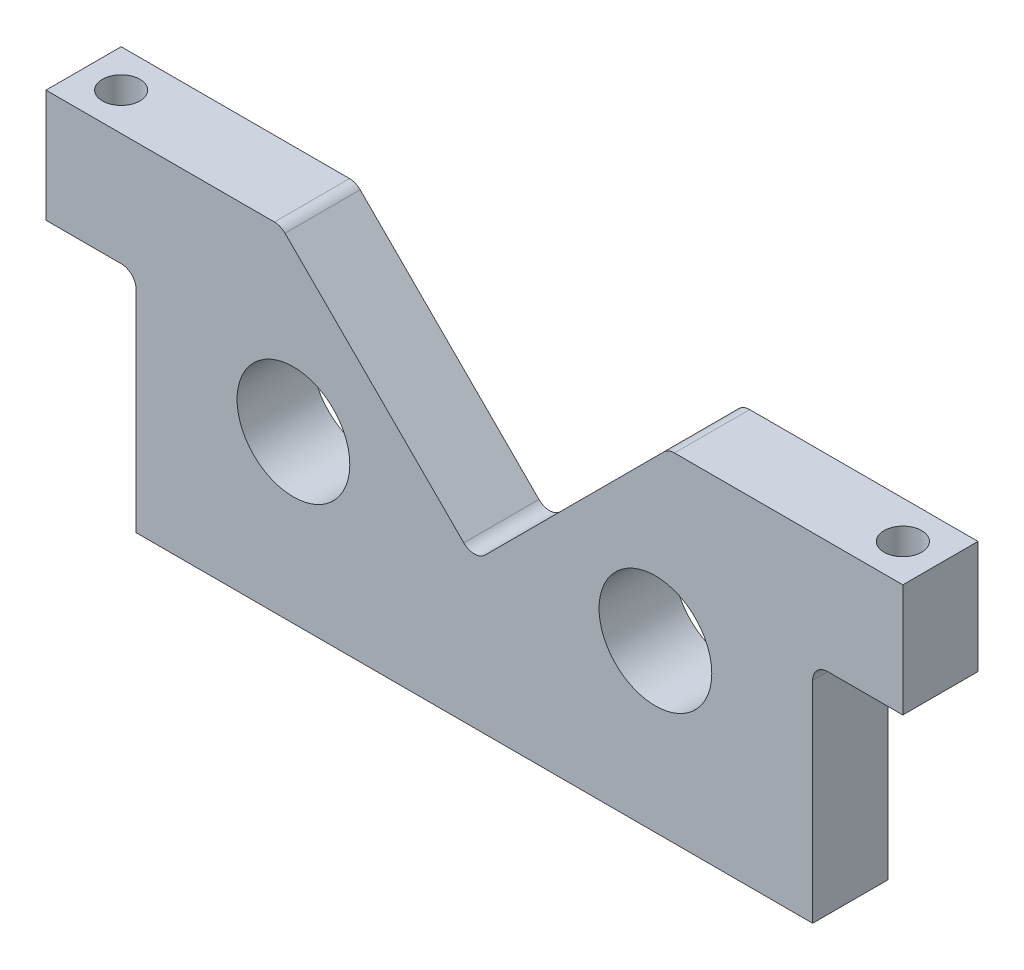
ISO-10303-21;
HEADER;
FILE_DESCRIPTION(('STEP AP214'),'2;1');
FILE_NAME('part.step','',(''),(''),'','','');
FILE_SCHEMA(('AUTOMOTIVE_DESIGN { 1 0 10303 214 1 1 1 1 }'));
ENDSEC;
DATA;
#1=APPLICATION_CONTEXT('core data for automotive mechanical design processes');
#2=APPLICATION_PROTOCOL_DEFINITION('international standard','automotive_design',2000,#1);
#3=PRODUCT_CONTEXT('',#1,'mechanical');
#4=PRODUCT('Part','Part','',(#3));
#5=PRODUCT_RELATED_PRODUCT_CATEGORY('part','',(#4));
#6=PRODUCT_DEFINITION_FORMATION('','',#4);
#7=PRODUCT_DEFINITION_CONTEXT('part definition',#1,'design');
#8=PRODUCT_DEFINITION('design','',#6,#7);
#9=PRODUCT_DEFINITION_SHAPE('','',#8);
#10=(LENGTH_UNIT() NAMED_UNIT(*) SI_UNIT(.MILLI.,.METRE.));
#11=(NAMED_UNIT(*) PLANE_ANGLE_UNIT() SI_UNIT($,.RADIAN.));
#12=(NAMED_UNIT(*) SI_UNIT($,.STERADIAN.) SOLID_ANGLE_UNIT());
#13=UNCERTAINTY_MEASURE_WITH_UNIT(LENGTH_MEASURE(1.E-05),#10,'distance_accuracy_value','');
#14=(GEOMETRIC_REPRESENTATION_CONTEXT(3) GLOBAL_UNCERTAINTY_ASSIGNED_CONTEXT((#13)) GLOBAL_UNIT_ASSIGNED_CONTEXT((#10,
#11,#12)) REPRESENTATION_CONTEXT('',''));
#15=CARTESIAN_POINT('',(0.,0.,0.));
#16=DIRECTION('',(0.,0.,1.));
#17=DIRECTION('',(1.,0.,0.));
#18=AXIS2_PLACEMENT_3D('',#15,#16,#17);
#19=CARTESIAN_POINT('',(45.,0.,5.));
#20=DIRECTION('',(-1.,0.,0.));
#21=DIRECTION('',(0.,-1.,0.));
#22=AXIS2_PLACEMENT_3D('',#19,#20,#21);
#23=PLANE('',#22);
#24=DIRECTION('',(0.,1.,0.));
#25=VECTOR('',#24,1.);
#26=CARTESIAN_POINT('',(45.,0.,-5.));
#27=LINE('',#26,#25);
#28=CARTESIAN_POINT('',(45.,-47.5,-5.));
#29=VERTEX_POINT('',#28);
#30=CARTESIAN_POINT('',(45.,-19.5,-5.));
#31=VERTEX_POINT('',#30);
#32=EDGE_CURVE('E227',#29,#31,#27,.T.);
#33=ORIENTED_EDGE('',*,*,#32,.T.);
#34=DIRECTION('',(0.,0.,-1.));
#35=VECTOR('',#34,1.);
#36=CARTESIAN_POINT('',(45.,-19.5,5.));
#37=LINE('',#36,#35);
#38=CARTESIAN_POINT('',(45.,-19.5,5.));
#39=VERTEX_POINT('',#38);
#40=EDGE_CURVE('E288',#39,#31,#37,.T.);
#41=ORIENTED_EDGE('',*,*,#40,.F.);
#42=DIRECTION('',(0.,1.,0.));
#43=VECTOR('',#42,1.);
#44=CARTESIAN_POINT('',(45.,0.,5.));
#45=LINE('',#44,#43);
#46=CARTESIAN_POINT('',(45.,-47.5,5.));
#47=VERTEX_POINT('',#46);
#48=EDGE_CURVE('E186',#47,#39,#45,.T.);
#49=ORIENTED_EDGE('',*,*,#48,.F.);
#50=DIRECTION('',(0.,0.,-1.));
#51=VECTOR('',#50,1.);
#52=CARTESIAN_POINT('',(45.,-47.5,5.));
#53=LINE('',#52,#51);
#54=EDGE_CURVE('E221',#47,#29,#53,.T.);
#55=ORIENTED_EDGE('',*,*,#54,.T.);
#56=EDGE_LOOP('',(#33,#41,#49,#55));
#57=FACE_BOUND('',#56,.T.);
#58=ADVANCED_FACE('F37',(#57),#23,.F.);
#59=CARTESIAN_POINT('',(47.,-19.5,5.));
#60=DIRECTION('',(0.,0.,-1.));
#61=DIRECTION('',(-1.,0.,0.));
#62=AXIS2_PLACEMENT_3D('',#59,#60,#61);
#63=CYLINDRICAL_SURFACE('',#62,2.);
#64=CARTESIAN_POINT('',(47.,-19.5,-5.));
#65=DIRECTION('',(0.,0.,1.));
#66=DIRECTION('',(1.,0.,0.));
#67=AXIS2_PLACEMENT_3D('',#64,#65,#66);
#68=CIRCLE('',#67,2.);
#69=CARTESIAN_POINT('',(47.,-17.5,-5.));
#70=VERTEX_POINT('',#69);
#71=EDGE_CURVE('E230',#31,#70,#68,.F.);
#72=ORIENTED_EDGE('',*,*,#71,.T.);
#73=DIRECTION('',(0.,0.,-1.));
#74=VECTOR('',#73,1.);
#75=CARTESIAN_POINT('',(47.,-17.5,5.));
#76=LINE('',#75,#74);
#77=CARTESIAN_POINT('',(47.,-17.5,5.));
#78=VERTEX_POINT('',#77);
#79=EDGE_CURVE('E285',#78,#70,#76,.T.);
#80=ORIENTED_EDGE('',*,*,#79,.F.);
#81=CARTESIAN_POINT('',(47.,-19.5,5.));
#82=DIRECTION('',(0.,0.,1.));
#83=DIRECTION('',(1.,0.,0.));
#84=AXIS2_PLACEMENT_3D('',#81,#82,#83);
#85=CIRCLE('',#84,2.);
#86=EDGE_CURVE('E189',#39,#78,#85,.F.);
#87=ORIENTED_EDGE('',*,*,#86,.F.);
#88=ORIENTED_EDGE('',*,*,#40,.T.);
#89=EDGE_LOOP('',(#72,#80,#87,#88));
#90=FACE_BOUND('',#89,.T.);
#91=ADVANCED_FACE('F340',(#90),#63,.F.);
#92=CARTESIAN_POINT('',(0.,-17.4999999999999,5.));
#93=DIRECTION('',(0.,1.,0.));
#94=DIRECTION('',(-1.,0.,0.));
#95=AXIS2_PLACEMENT_3D('',#92,#93,#94);
#96=PLANE('',#95);
#97=CARTESIAN_POINT('',(52.,-17.5,0.));
#98=DIRECTION('',(0.,1.,0.));
#99=DIRECTION('',(-1.,0.,0.));
#100=AXIS2_PLACEMENT_3D('',#97,#98,#99);
#101=CIRCLE('',#100,2.5);
#102=CARTESIAN_POINT('',(49.5,-17.5,0.));
#103=VERTEX_POINT('',#102);
#104=EDGE_CURVE('E434',#103,#103,#101,.T.);
#105=ORIENTED_EDGE('',*,*,#104,.T.);
#106=EDGE_LOOP('',(#105));
#107=FACE_BOUND('',#106,.T.);
#108=DIRECTION('',(1.,0.,0.));
#109=VECTOR('',#108,1.);
#110=CARTESIAN_POINT('',(0.,-17.4999999999999,-5.));
#111=LINE('',#110,#109);
#112=CARTESIAN_POINT('',(57.,-17.5,-5.));
#113=VERTEX_POINT('',#112);
#114=EDGE_CURVE('E232',#70,#113,#111,.T.);
#115=ORIENTED_EDGE('',*,*,#114,.T.);
#116=DIRECTION('',(0.,0.,-1.));
#117=VECTOR('',#116,1.);
#118=CARTESIAN_POINT('',(57.,-17.5,5.));
#119=LINE('',#118,#117);
#120=CARTESIAN_POINT('',(57.,-17.5,5.));
#121=VERTEX_POINT('',#120);
#122=EDGE_CURVE('E283',#121,#113,#119,.T.);
#123=ORIENTED_EDGE('',*,*,#122,.F.);
#124=DIRECTION('',(1.,0.,0.));
#125=VECTOR('',#124,1.);
#126=CARTESIAN_POINT('',(0.,-17.4999999999999,5.));
#127=LINE('',#126,#125);
#128=EDGE_CURVE('E191',#78,#121,#127,.T.);
#129=ORIENTED_EDGE('',*,*,#128,.F.);
#130=ORIENTED_EDGE('',*,*,#79,.T.);
#131=EDGE_LOOP('',(#115,#123,#129,#130));
#132=FACE_BOUND('',#131,.T.);
#133=ADVANCED_FACE('F346',(#107,#132),#96,.F.);
#134=CARTESIAN_POINT('',(57.,0.,5.));
#135=DIRECTION('',(1.,0.,0.));
#136=DIRECTION('',(0.,1.,0.));
#137=AXIS2_PLACEMENT_3D('',#134,#135,#136);
#138=PLANE('',#137);
#139=DIRECTION('',(0.,-1.,0.));
#140=VECTOR('',#139,1.);
#141=CARTESIAN_POINT('',(57.,0.,-5.));
#142=LINE('',#141,#140);
#143=CARTESIAN_POINT('',(57.,-2.49999999999996,-5.));
#144=VERTEX_POINT('',#143);
#145=EDGE_CURVE('E235',#144,#113,#142,.T.);
#146=ORIENTED_EDGE('',*,*,#145,.F.);
#147=DIRECTION('',(0.,0.,-1.));
#148=VECTOR('',#147,1.);
#149=CARTESIAN_POINT('',(57.,-2.49999999999996,5.));
#150=LINE('',#149,#148);
#151=CARTESIAN_POINT('',(57.,-2.49999999999996,5.));
#152=VERTEX_POINT('',#151);
#153=EDGE_CURVE('E280',#152,#144,#150,.T.);
#154=ORIENTED_EDGE('',*,*,#153,.F.);
#155=DIRECTION('',(0.,-1.,0.));
#156=VECTOR('',#155,1.);
#157=CARTESIAN_POINT('',(57.,0.,5.));
#158=LINE('',#157,#156);
#159=EDGE_CURVE('E193',#152,#121,#158,.T.);
#160=ORIENTED_EDGE('',*,*,#159,.T.);
#161=ORIENTED_EDGE('',*,*,#122,.T.);
#162=EDGE_LOOP('',(#146,#154,#160,#161));
#163=FACE_BOUND('',#162,.T.);
#164=ADVANCED_FACE('F382',(#163),#138,.T.);
#165=CARTESIAN_POINT('',(0.,-2.50000000000024,5.));
#166=DIRECTION('',(0.,1.,0.));
#167=DIRECTION('',(-1.,0.,0.));
#168=AXIS2_PLACEMENT_3D('',#165,#166,#167);
#169=PLANE('',#168);
#170=CARTESIAN_POINT('',(52.,-2.49999999999998,0.));
#171=DIRECTION('',(0.,1.,0.));
#172=DIRECTION('',(0.,0.,1.));
#173=AXIS2_PLACEMENT_3D('',#170,#171,#172);
#174=CIRCLE('',#173,2.5);
#175=CARTESIAN_POINT('',(52.,-2.49999999999998,2.5));
#176=VERTEX_POINT('',#175);
#177=EDGE_CURVE('E437',#176,#176,#174,.T.);
#178=ORIENTED_EDGE('',*,*,#177,.F.);
#179=EDGE_LOOP('',(#178));
#180=FACE_BOUND('',#179,.T.);
#181=DIRECTION('',(1.,0.,0.));
#182=VECTOR('',#181,1.);
#183=CARTESIAN_POINT('',(0.,-2.50000000000024,-5.));
#184=LINE('',#183,#182);
#185=CARTESIAN_POINT('',(26.612698372208,-2.50000000000011,-5.));
#186=VERTEX_POINT('',#185);
#187=EDGE_CURVE('E238',#186,#144,#184,.T.);
#188=ORIENTED_EDGE('',*,*,#187,.F.);
#189=DIRECTION('',(0.,0.,-1.));
#190=VECTOR('',#189,1.);
#191=CARTESIAN_POINT('',(26.612698372208,-2.50000000000011,5.));
#192=LINE('',#191,#190);
#193=CARTESIAN_POINT('',(26.612698372208,-2.50000000000011,5.));
#194=VERTEX_POINT('',#193);
#195=EDGE_CURVE('E298',#186,#194,#192,.F.);
#196=ORIENTED_EDGE('',*,*,#195,.T.);
#197=DIRECTION('',(1.,0.,0.));
#198=VECTOR('',#197,1.);
#199=CARTESIAN_POINT('',(0.,-2.50000000000024,5.));
#200=LINE('',#199,#198);
#201=EDGE_CURVE('E196',#194,#152,#200,.T.);
#202=ORIENTED_EDGE('',*,*,#201,.T.);
#203=ORIENTED_EDGE('',*,*,#153,.T.);
#204=EDGE_LOOP('',(#188,#196,#202,#203));
#205=FACE_BOUND('',#204,.T.);
#206=ADVANCED_FACE('F378',(#180,#205),#169,.T.);
#207=CARTESIAN_POINT('',(14.1421356237309,-14.1421356237309,5.));
#208=DIRECTION('',(-0.707106781186547,0.707106781186548,0.));
#209=DIRECTION('',(-0.707106781186548,-0.707106781186547,0.));
#210=AXIS2_PLACEMENT_3D('',#207,#208,#209);
#211=PLANE('',#210);
#212=DIRECTION('',(0.707106781186548,0.707106781186547,0.));
#213=VECTOR('',#212,1.);
#214=CARTESIAN_POINT('',(14.1421356237309,-14.1421356237309,5.));
#215=LINE('',#214,#213);
#216=CARTESIAN_POINT('',(1.41421356237308,-26.8700576850888,5.));
#217=VERTEX_POINT('',#216);
#218=CARTESIAN_POINT('',(25.1984848098349,-3.08578643762701,5.));
#219=VERTEX_POINT('',#218);
#220=EDGE_CURVE('E198',#217,#219,#215,.T.);
#221=ORIENTED_EDGE('',*,*,#220,.T.);
#222=DIRECTION('',(0.,0.,-1.));
#223=VECTOR('',#222,1.);
#224=CARTESIAN_POINT('',(25.1984848098349,-3.08578643762701,5.));
#225=LINE('',#224,#223);
#226=CARTESIAN_POINT('',(25.1984848098349,-3.08578643762701,-5.));
#227=VERTEX_POINT('',#226);
#228=EDGE_CURVE('E291',#219,#227,#225,.T.);
#229=ORIENTED_EDGE('',*,*,#228,.T.);
#230=DIRECTION('',(0.707106781186548,0.707106781186547,0.));
#231=VECTOR('',#230,1.);
#232=CARTESIAN_POINT('',(14.1421356237309,-14.1421356237309,-5.));
#233=LINE('',#232,#231);
#234=CARTESIAN_POINT('',(1.41421356237308,-26.8700576850888,-5.));
#235=VERTEX_POINT('',#234);
#236=EDGE_CURVE('E240',#235,#227,#233,.T.);
#237=ORIENTED_EDGE('',*,*,#236,.F.);
#238=DIRECTION('',(0.,0.,-1.));
#239=VECTOR('',#238,1.);
#240=CARTESIAN_POINT('',(1.41421356237308,-26.8700576850888,5.));
#241=LINE('',#240,#239);
#242=EDGE_CURVE('E278',#217,#235,#241,.T.);
#243=ORIENTED_EDGE('',*,*,#242,.F.);
#244=EDGE_LOOP('',(#221,#229,#237,#243));
#245=FACE_BOUND('',#244,.T.);
#246=ADVANCED_FACE('F368',(#245),#211,.T.);
#247=CARTESIAN_POINT('',(0.,-25.4558441227157,5.));
#248=DIRECTION('',(0.,0.,-1.));
#249=DIRECTION('',(-1.,0.,0.));
#250=AXIS2_PLACEMENT_3D('',#247,#248,#249);
#251=CYLINDRICAL_SURFACE('',#250,2.);
#252=CARTESIAN_POINT('',(0.,-25.4558441227157,-5.));
#253=DIRECTION('',(0.,0.,1.));
#254=DIRECTION('',(1.,0.,0.));
#255=AXIS2_PLACEMENT_3D('',#252,#253,#254);
#256=CIRCLE('',#255,2.);
#257=CARTESIAN_POINT('',(-1.41421356237311,-26.8700576850888,-5.));
#258=VERTEX_POINT('',#257);
#259=EDGE_CURVE('E243',#235,#258,#256,.F.);
#260=ORIENTED_EDGE('',*,*,#259,.T.);
#261=DIRECTION('',(0.,0.,-1.));
#262=VECTOR('',#261,1.);
#263=CARTESIAN_POINT('',(-1.41421356237311,-26.8700576850888,5.));
#264=LINE('',#263,#262);
#265=CARTESIAN_POINT('',(-1.41421356237311,-26.8700576850888,5.));
#266=VERTEX_POINT('',#265);
#267=EDGE_CURVE('E275',#266,#258,#264,.T.);
#268=ORIENTED_EDGE('',*,*,#267,.F.);
#269=CARTESIAN_POINT('',(0.,-25.4558441227157,5.));
#270=DIRECTION('',(0.,0.,1.));
#271=DIRECTION('',(1.,0.,0.));
#272=AXIS2_PLACEMENT_3D('',#269,#270,#271);
#273=CIRCLE('',#272,2.);
#274=EDGE_CURVE('E201',#217,#266,#273,.F.);
#275=ORIENTED_EDGE('',*,*,#274,.F.);
#276=ORIENTED_EDGE('',*,*,#242,.T.);
#277=EDGE_LOOP('',(#260,#268,#275,#276));
#278=FACE_BOUND('',#277,.T.);
#279=ADVANCED_FACE('F374',(#278),#251,.F.);
#280=CARTESIAN_POINT('',(-14.142135623731,-14.1421356237309,5.));
#281=DIRECTION('',(-0.707106781186548,-0.707106781186547,0.));
#282=DIRECTION('',(0.707106781186547,-0.707106781186548,0.));
#283=AXIS2_PLACEMENT_3D('',#280,#281,#282);
#284=PLANE('',#283);
#285=DIRECTION('',(-0.707106781186547,0.707106781186548,0.));
#286=VECTOR('',#285,1.);
#287=CARTESIAN_POINT('',(-14.142135623731,-14.1421356237309,-5.));
#288=LINE('',#287,#286);
#289=CARTESIAN_POINT('',(-25.198484809835,-3.08578643762692,-5.));
#290=VERTEX_POINT('',#289);
#291=EDGE_CURVE('E245',#258,#290,#288,.T.);
#292=ORIENTED_EDGE('',*,*,#291,.T.);
#293=DIRECTION('',(0.,0.,-1.));
#294=VECTOR('',#293,1.);
#295=CARTESIAN_POINT('',(-25.198484809835,-3.08578643762692,5.));
#296=LINE('',#295,#294);
#297=CARTESIAN_POINT('',(-25.198484809835,-3.08578643762692,5.));
#298=VERTEX_POINT('',#297);
#299=EDGE_CURVE('E11',#290,#298,#296,.F.);
#300=ORIENTED_EDGE('',*,*,#299,.T.);
#301=DIRECTION('',(-0.707106781186547,0.707106781186548,0.));
#302=VECTOR('',#301,1.);
#303=CARTESIAN_POINT('',(-14.142135623731,-14.1421356237309,5.));
#304=LINE('',#303,#302);
#305=EDGE_CURVE('E203',#266,#298,#304,.T.);
#306=ORIENTED_EDGE('',*,*,#305,.F.);
#307=ORIENTED_EDGE('',*,*,#267,.T.);
#308=EDGE_LOOP('',(#292,#300,#306,#307));
#309=FACE_BOUND('',#308,.T.);
#310=ADVANCED_FACE('F375',(#309),#284,.F.);
#311=CARTESIAN_POINT('',(0.,-2.50000000000002,5.));
#312=DIRECTION('',(0.,1.,0.));
#313=DIRECTION('',(0.,0.,1.));
#314=AXIS2_PLACEMENT_3D('',#311,#312,#313);
#315=PLANE('',#314);
#316=CARTESIAN_POINT('',(-52.,-2.5000000000005,0.));
#317=DIRECTION('',(0.,1.,0.));
#318=DIRECTION('',(0.,0.,1.));
#319=AXIS2_PLACEMENT_3D('',#316,#317,#318);
#320=CIRCLE('',#319,2.5);
#321=CARTESIAN_POINT('',(-52.,-2.5000000000005,2.5));
#322=VERTEX_POINT('',#321);
#323=EDGE_CURVE('E436',#322,#322,#320,.T.);
#324=ORIENTED_EDGE('',*,*,#323,.F.);
#325=EDGE_LOOP('',(#324));
#326=FACE_BOUND('',#325,.T.);
#327=DIRECTION('',(1.,0.,0.));
#328=VECTOR('',#327,1.);
#329=CARTESIAN_POINT('',(0.,-2.50000000000002,5.));
#330=LINE('',#329,#328);
#331=CARTESIAN_POINT('',(-57.,-2.49999999999996,5.));
#332=VERTEX_POINT('',#331);
#333=CARTESIAN_POINT('',(-26.6126983722081,-2.50000000000002,5.));
#334=VERTEX_POINT('',#333);
#335=EDGE_CURVE('E205',#332,#334,#330,.T.);
#336=ORIENTED_EDGE('',*,*,#335,.T.);
#337=DIRECTION('',(0.,0.,-1.));
#338=VECTOR('',#337,1.);
#339=CARTESIAN_POINT('',(-26.6126983722081,-2.50000000000002,-5.));
#340=LINE('',#339,#338);
#341=CARTESIAN_POINT('',(-26.6126983722081,-2.50000000000002,-5.));
#342=VERTEX_POINT('',#341);
#343=EDGE_CURVE('E45',#334,#342,#340,.T.);
#344=ORIENTED_EDGE('',*,*,#343,.T.);
#345=DIRECTION('',(1.,0.,0.));
#346=VECTOR('',#345,1.);
#347=CARTESIAN_POINT('',(0.,-2.50000000000002,-5.));
#348=LINE('',#347,#346);
#349=CARTESIAN_POINT('',(-57.,-2.49999999999996,-5.));
#350=VERTEX_POINT('',#349);
#351=EDGE_CURVE('E247',#350,#342,#348,.T.);
#352=ORIENTED_EDGE('',*,*,#351,.F.);
#353=DIRECTION('',(0.,0.,-1.));
#354=VECTOR('',#353,1.);
#355=CARTESIAN_POINT('',(-57.,-2.49999999999996,5.));
#356=LINE('',#355,#354);
#357=EDGE_CURVE('E273',#332,#350,#356,.T.);
#358=ORIENTED_EDGE('',*,*,#357,.F.);
#359=EDGE_LOOP('',(#336,#344,#352,#358));
#360=FACE_BOUND('',#359,.T.);
#361=ADVANCED_FACE('F306',(#326,#360),#315,.T.);
#362=CARTESIAN_POINT('',(-57.,0.,5.));
#363=DIRECTION('',(1.,0.,0.));
#364=DIRECTION('',(0.,1.,0.));
#365=AXIS2_PLACEMENT_3D('',#362,#363,#364);
#366=PLANE('',#365);
#367=DIRECTION('',(0.,-1.,0.));
#368=VECTOR('',#367,1.);
#369=CARTESIAN_POINT('',(-57.,0.,-5.));
#370=LINE('',#369,#368);
#371=CARTESIAN_POINT('',(-57.,-17.5,-5.));
#372=VERTEX_POINT('',#371);
#373=EDGE_CURVE('E250',#350,#372,#370,.T.);
#374=ORIENTED_EDGE('',*,*,#373,.T.);
#375=DIRECTION('',(0.,0.,-1.));
#376=VECTOR('',#375,1.);
#377=CARTESIAN_POINT('',(-57.,-17.5,5.));
#378=LINE('',#377,#376);
#379=CARTESIAN_POINT('',(-57.,-17.5,5.));
#380=VERTEX_POINT('',#379);
#381=EDGE_CURVE('E271',#380,#372,#378,.T.);
#382=ORIENTED_EDGE('',*,*,#381,.F.);
#383=DIRECTION('',(0.,-1.,0.));
#384=VECTOR('',#383,1.);
#385=CARTESIAN_POINT('',(-57.,0.,5.));
#386=LINE('',#385,#384);
#387=EDGE_CURVE('E207',#332,#380,#386,.T.);
#388=ORIENTED_EDGE('',*,*,#387,.F.);
#389=ORIENTED_EDGE('',*,*,#357,.T.);
#390=EDGE_LOOP('',(#374,#382,#388,#389));
#391=FACE_BOUND('',#390,.T.);
#392=ADVANCED_FACE('F315',(#391),#366,.F.);
#393=CARTESIAN_POINT('',(0.,-17.5,5.));
#394=DIRECTION('',(0.,-1.,0.));
#395=DIRECTION('',(1.,0.,0.));
#396=AXIS2_PLACEMENT_3D('',#393,#394,#395);
#397=PLANE('',#396);
#398=CARTESIAN_POINT('',(-52.,-17.5,0.));
#399=DIRECTION('',(0.,-1.,0.));
#400=DIRECTION('',(1.,0.,0.));
#401=AXIS2_PLACEMENT_3D('',#398,#399,#400);
#402=CIRCLE('',#401,2.5);
#403=CARTESIAN_POINT('',(-49.5,-17.5,0.));
#404=VERTEX_POINT('',#403);
#405=EDGE_CURVE('E172',#404,#404,#402,.T.);
#406=ORIENTED_EDGE('',*,*,#405,.F.);
#407=EDGE_LOOP('',(#406));
#408=FACE_BOUND('',#407,.T.);
#409=DIRECTION('',(-1.,0.,0.));
#410=VECTOR('',#409,1.);
#411=CARTESIAN_POINT('',(0.,-17.5,-5.));
#412=LINE('',#411,#410);
#413=CARTESIAN_POINT('',(-47.,-17.5,-5.));
#414=VERTEX_POINT('',#413);
#415=EDGE_CURVE('E253',#414,#372,#412,.T.);
#416=ORIENTED_EDGE('',*,*,#415,.F.);
#417=DIRECTION('',(0.,0.,-1.));
#418=VECTOR('',#417,1.);
#419=CARTESIAN_POINT('',(-47.,-17.5,5.));
#420=LINE('',#419,#418);
#421=CARTESIAN_POINT('',(-47.,-17.5,5.));
#422=VERTEX_POINT('',#421);
#423=EDGE_CURVE('E269',#422,#414,#420,.T.);
#424=ORIENTED_EDGE('',*,*,#423,.F.);
#425=DIRECTION('',(-1.,0.,0.));
#426=VECTOR('',#425,1.);
#427=CARTESIAN_POINT('',(0.,-17.5,5.));
#428=LINE('',#427,#426);
#429=EDGE_CURVE('E209',#422,#380,#428,.T.);
#430=ORIENTED_EDGE('',*,*,#429,.T.);
#431=ORIENTED_EDGE('',*,*,#381,.T.);
#432=EDGE_LOOP('',(#416,#424,#430,#431));
#433=FACE_BOUND('',#432,.T.);
#434=ADVANCED_FACE('F402',(#408,#433),#397,.T.);
#435=CARTESIAN_POINT('',(-47.,-19.5,5.));
#436=DIRECTION('',(0.,0.,-1.));
#437=DIRECTION('',(-1.,0.,0.));
#438=AXIS2_PLACEMENT_3D('',#435,#436,#437);
#439=CYLINDRICAL_SURFACE('',#438,2.);
#440=CARTESIAN_POINT('',(-47.,-19.5,-5.));
#441=DIRECTION('',(0.,0.,1.));
#442=DIRECTION('',(1.,0.,0.));
#443=AXIS2_PLACEMENT_3D('',#440,#441,#442);
#444=CIRCLE('',#443,2.);
#445=CARTESIAN_POINT('',(-45.,-19.5,-5.));
#446=VERTEX_POINT('',#445);
#447=EDGE_CURVE('E256',#446,#414,#444,.T.);
#448=ORIENTED_EDGE('',*,*,#447,.F.);
#449=DIRECTION('',(0.,0.,-1.));
#450=VECTOR('',#449,1.);
#451=CARTESIAN_POINT('',(-45.,-19.5,5.));
#452=LINE('',#451,#450);
#453=CARTESIAN_POINT('',(-45.,-19.5,5.));
#454=VERTEX_POINT('',#453);
#455=EDGE_CURVE('E267',#454,#446,#452,.T.);
#456=ORIENTED_EDGE('',*,*,#455,.F.);
#457=CARTESIAN_POINT('',(-47.,-19.5,5.));
#458=DIRECTION('',(0.,0.,1.));
#459=DIRECTION('',(1.,0.,0.));
#460=AXIS2_PLACEMENT_3D('',#457,#458,#459);
#461=CIRCLE('',#460,2.);
#462=EDGE_CURVE('E212',#454,#422,#461,.T.);
#463=ORIENTED_EDGE('',*,*,#462,.T.);
#464=ORIENTED_EDGE('',*,*,#423,.T.);
#465=EDGE_LOOP('',(#448,#456,#463,#464));
#466=FACE_BOUND('',#465,.T.);
#467=ADVANCED_FACE('F399',(#466),#439,.F.);
#468=CARTESIAN_POINT('',(-45.,0.,5.));
#469=DIRECTION('',(-1.,0.,0.));
#470=DIRECTION('',(0.,-1.,0.));
#471=AXIS2_PLACEMENT_3D('',#468,#469,#470);
#472=PLANE('',#471);
#473=DIRECTION('',(0.,1.,0.));
#474=VECTOR('',#473,1.);
#475=CARTESIAN_POINT('',(-45.,0.,-5.));
#476=LINE('',#475,#474);
#477=CARTESIAN_POINT('',(-45.,-47.5,-5.));
#478=VERTEX_POINT('',#477);
#479=EDGE_CURVE('E259',#478,#446,#476,.T.);
#480=ORIENTED_EDGE('',*,*,#479,.F.);
#481=DIRECTION('',(0.,0.,-1.));
#482=VECTOR('',#481,1.);
#483=CARTESIAN_POINT('',(-45.,-47.5,5.));
#484=LINE('',#483,#482);
#485=CARTESIAN_POINT('',(-45.,-47.5,5.));
#486=VERTEX_POINT('',#485);
#487=EDGE_CURVE('E265',#486,#478,#484,.T.);
#488=ORIENTED_EDGE('',*,*,#487,.F.);
#489=DIRECTION('',(0.,1.,0.));
#490=VECTOR('',#489,1.);
#491=CARTESIAN_POINT('',(-45.,0.,5.));
#492=LINE('',#491,#490);
#493=EDGE_CURVE('E215',#486,#454,#492,.T.);
#494=ORIENTED_EDGE('',*,*,#493,.T.);
#495=ORIENTED_EDGE('',*,*,#455,.T.);
#496=EDGE_LOOP('',(#480,#488,#494,#495));
#497=FACE_BOUND('',#496,.T.);
#498=ADVANCED_FACE('F354',(#497),#472,.T.);
#499=CARTESIAN_POINT('',(-24.0798525485149,-25.4176221345435,5.));
#500=DIRECTION('',(0.,0.,-1.));
#501=DIRECTION('',(-1.,0.,0.));
#502=AXIS2_PLACEMENT_3D('',#499,#500,#501);
#503=CYLINDRICAL_SURFACE('',#502,7.5);
#504=CARTESIAN_POINT('',(-24.0798525485149,-25.4176221345435,5.));
#505=DIRECTION('',(0.,0.,1.));
#506=DIRECTION('',(1.,0.,0.));
#507=AXIS2_PLACEMENT_3D('',#504,#505,#506);
#508=CIRCLE('',#507,7.5);
#509=CARTESIAN_POINT('',(-16.5798525485149,-25.4176221345435,5.));
#510=VERTEX_POINT('',#509);
#511=EDGE_CURVE('E182',#510,#510,#508,.F.);
#512=ORIENTED_EDGE('',*,*,#511,.F.);
#513=EDGE_LOOP('',(#512));
#514=FACE_BOUND('',#513,.T.);
#515=CARTESIAN_POINT('',(-24.0798525485149,-25.4176221345435,-5.));
#516=DIRECTION('',(0.,0.,1.));
#517=DIRECTION('',(1.,0.,0.));
#518=AXIS2_PLACEMENT_3D('',#515,#516,#517);
#519=CIRCLE('',#518,7.5);
#520=CARTESIAN_POINT('',(-16.5798525485149,-25.4176221345435,-5.));
#521=VERTEX_POINT('',#520);
#522=EDGE_CURVE('E224',#521,#521,#519,.F.);
#523=ORIENTED_EDGE('',*,*,#522,.T.);
#524=EDGE_LOOP('',(#523));
#525=FACE_BOUND('',#524,.T.);
#526=ADVANCED_FACE('F351',(#514,#525),#503,.F.);
#527=CARTESIAN_POINT('',(24.0798525485149,-25.4176221345435,5.));
#528=DIRECTION('',(0.,0.,-1.));
#529=DIRECTION('',(-1.,0.,0.));
#530=AXIS2_PLACEMENT_3D('',#527,#528,#529);
#531=CYLINDRICAL_SURFACE('',#530,7.50000000000002);
#532=CARTESIAN_POINT('',(24.0798525485149,-25.4176221345435,5.));
#533=DIRECTION('',(0.,0.,1.));
#534=DIRECTION('',(1.,0.,0.));
#535=AXIS2_PLACEMENT_3D('',#532,#533,#534);
#536=CIRCLE('',#535,7.50000000000002);
#537=CARTESIAN_POINT('',(31.5798525485149,-25.4176221345435,5.));
#538=VERTEX_POINT('',#537);
#539=EDGE_CURVE('E179',#538,#538,#536,.T.);
#540=ORIENTED_EDGE('',*,*,#539,.T.);
#541=EDGE_LOOP('',(#540));
#542=FACE_BOUND('',#541,.T.);
#543=CARTESIAN_POINT('',(24.0798525485149,-25.4176221345435,-5.));
#544=DIRECTION('',(0.,0.,1.));
#545=DIRECTION('',(1.,0.,0.));
#546=AXIS2_PLACEMENT_3D('',#543,#544,#545);
#547=CIRCLE('',#546,7.50000000000002);
#548=CARTESIAN_POINT('',(31.5798525485149,-25.4176221345435,-5.));
#549=VERTEX_POINT('',#548);
#550=EDGE_CURVE('E178',#549,#549,#547,.T.);
#551=ORIENTED_EDGE('',*,*,#550,.F.);
#552=EDGE_LOOP('',(#551));
#553=FACE_BOUND('',#552,.T.);
#554=ADVANCED_FACE('F333',(#542,#553),#531,.F.);
#555=CARTESIAN_POINT('',(0.,-47.5,5.));
#556=DIRECTION('',(0.,-1.,0.));
#557=DIRECTION('',(0.,0.,-1.));
#558=AXIS2_PLACEMENT_3D('',#555,#556,#557);
#559=PLANE('',#558);
#560=CARTESIAN_POINT('',(-35.,-47.5,0.));
#561=DIRECTION('',(0.,-1.,0.));
#562=DIRECTION('',(0.,0.,-1.));
#563=AXIS2_PLACEMENT_3D('',#560,#561,#562);
#564=CIRCLE('',#563,2.1);
#565=CARTESIAN_POINT('',(-35.,-47.5,-2.1));
#566=VERTEX_POINT('',#565);
#567=EDGE_CURVE('E166',#566,#566,#564,.T.);
#568=ORIENTED_EDGE('',*,*,#567,.F.);
#569=EDGE_LOOP('',(#568));
#570=FACE_BOUND('',#569,.T.);
#571=CARTESIAN_POINT('',(35.,-47.5,0.));
#572=DIRECTION('',(0.,-1.,0.));
#573=DIRECTION('',(0.,0.,-1.));
#574=AXIS2_PLACEMENT_3D('',#571,#572,#573);
#575=CIRCLE('',#574,2.1);
#576=CARTESIAN_POINT('',(35.,-47.5,-2.1));
#577=VERTEX_POINT('',#576);
#578=EDGE_CURVE('E165',#577,#577,#575,.T.);
#579=ORIENTED_EDGE('',*,*,#578,.F.);
#580=EDGE_LOOP('',(#579));
#581=FACE_BOUND('',#580,.T.);
#582=DIRECTION('',(-1.,0.,0.));
#583=VECTOR('',#582,1.);
#584=CARTESIAN_POINT('',(0.,-47.5,-5.));
#585=LINE('',#584,#583);
#586=EDGE_CURVE('E183',#29,#478,#585,.T.);
#587=ORIENTED_EDGE('',*,*,#586,.F.);
#588=ORIENTED_EDGE('',*,*,#54,.F.);
#589=DIRECTION('',(-1.,0.,0.));
#590=VECTOR('',#589,1.);
#591=CARTESIAN_POINT('',(0.,-47.5,5.));
#592=LINE('',#591,#590);
#593=EDGE_CURVE('E218',#47,#486,#592,.T.);
#594=ORIENTED_EDGE('',*,*,#593,.T.);
#595=ORIENTED_EDGE('',*,*,#487,.T.);
#596=EDGE_LOOP('',(#587,#588,#594,#595));
#597=FACE_BOUND('',#596,.T.);
#598=ADVANCED_FACE('F323',(#570,#581,#597),#559,.T.);
#599=CARTESIAN_POINT('',(0.,0.,5.));
#600=DIRECTION('',(0.,0.,1.));
#601=DIRECTION('',(1.,0.,0.));
#602=AXIS2_PLACEMENT_3D('',#599,#600,#601);
#603=PLANE('',#602);
#604=ORIENTED_EDGE('',*,*,#539,.F.);
#605=EDGE_LOOP('',(#604));
#606=FACE_BOUND('',#605,.T.);
#607=ORIENTED_EDGE('',*,*,#511,.T.);
#608=EDGE_LOOP('',(#607));
#609=FACE_BOUND('',#608,.T.);
#610=ORIENTED_EDGE('',*,*,#201,.F.);
#611=CARTESIAN_POINT('',(26.612698372208,-4.50000000000011,5.));
#612=DIRECTION('',(0.,0.,1.));
#613=DIRECTION('',(1.,0.,0.));
#614=AXIS2_PLACEMENT_3D('',#611,#612,#613);
#615=CIRCLE('',#614,2.);
#616=EDGE_CURVE('E301',#194,#219,#615,.T.);
#617=ORIENTED_EDGE('',*,*,#616,.T.);
#618=ORIENTED_EDGE('',*,*,#220,.F.);
#619=ORIENTED_EDGE('',*,*,#274,.T.);
#620=ORIENTED_EDGE('',*,*,#305,.T.);
#621=CARTESIAN_POINT('',(-26.6126983722081,-4.50000000000002,5.));
#622=DIRECTION('',(0.,0.,1.));
#623=DIRECTION('',(1.,0.,0.));
#624=AXIS2_PLACEMENT_3D('',#621,#622,#623);
#625=CIRCLE('',#624,2.);
#626=EDGE_CURVE('E52',#298,#334,#625,.T.);
#627=ORIENTED_EDGE('',*,*,#626,.T.);
#628=ORIENTED_EDGE('',*,*,#335,.F.);
#629=ORIENTED_EDGE('',*,*,#387,.T.);
#630=ORIENTED_EDGE('',*,*,#429,.F.);
#631=ORIENTED_EDGE('',*,*,#462,.F.);
#632=ORIENTED_EDGE('',*,*,#493,.F.);
#633=ORIENTED_EDGE('',*,*,#593,.F.);
#634=ORIENTED_EDGE('',*,*,#48,.T.);
#635=ORIENTED_EDGE('',*,*,#86,.T.);
#636=ORIENTED_EDGE('',*,*,#128,.T.);
#637=ORIENTED_EDGE('',*,*,#159,.F.);
#638=EDGE_LOOP('',(#610,#617,#618,#619,#620,#627,#628,#629,#630,#631,#632,#633,#634,#635,#636,#637));
#639=FACE_BOUND('',#638,.T.);
#640=ADVANCED_FACE('F319',(#606,#609,#639),#603,.T.);
#641=CARTESIAN_POINT('',(0.,0.,-5.));
#642=DIRECTION('',(0.,0.,1.));
#643=DIRECTION('',(1.,0.,0.));
#644=AXIS2_PLACEMENT_3D('',#641,#642,#643);
#645=PLANE('',#644);
#646=ORIENTED_EDGE('',*,*,#550,.T.);
#647=EDGE_LOOP('',(#646));
#648=FACE_BOUND('',#647,.T.);
#649=ORIENTED_EDGE('',*,*,#522,.F.);
#650=EDGE_LOOP('',(#649));
#651=FACE_BOUND('',#650,.T.);
#652=ORIENTED_EDGE('',*,*,#236,.T.);
#653=CARTESIAN_POINT('',(26.612698372208,-4.50000000000011,-5.));
#654=DIRECTION('',(0.,0.,1.));
#655=DIRECTION('',(1.,0.,0.));
#656=AXIS2_PLACEMENT_3D('',#653,#654,#655);
#657=CIRCLE('',#656,2.);
#658=EDGE_CURVE('E296',#227,#186,#657,.F.);
#659=ORIENTED_EDGE('',*,*,#658,.T.);
#660=ORIENTED_EDGE('',*,*,#187,.T.);
#661=ORIENTED_EDGE('',*,*,#145,.T.);
#662=ORIENTED_EDGE('',*,*,#114,.F.);
#663=ORIENTED_EDGE('',*,*,#71,.F.);
#664=ORIENTED_EDGE('',*,*,#32,.F.);
#665=ORIENTED_EDGE('',*,*,#586,.T.);
#666=ORIENTED_EDGE('',*,*,#479,.T.);
#667=ORIENTED_EDGE('',*,*,#447,.T.);
#668=ORIENTED_EDGE('',*,*,#415,.T.);
#669=ORIENTED_EDGE('',*,*,#373,.F.);
#670=ORIENTED_EDGE('',*,*,#351,.T.);
#671=CARTESIAN_POINT('',(-26.6126983722081,-4.50000000000002,-5.));
#672=DIRECTION('',(0.,0.,1.));
#673=DIRECTION('',(1.,0.,0.));
#674=AXIS2_PLACEMENT_3D('',#671,#672,#673);
#675=CIRCLE('',#674,2.);
#676=EDGE_CURVE('E294',#342,#290,#675,.F.);
#677=ORIENTED_EDGE('',*,*,#676,.T.);
#678=ORIENTED_EDGE('',*,*,#291,.F.);
#679=ORIENTED_EDGE('',*,*,#259,.F.);
#680=EDGE_LOOP('',(#652,#659,#660,#661,#662,#663,#664,#665,#666,#667,#668,#669,#670,#677,#678,#679));
#681=FACE_BOUND('',#680,.T.);
#682=ADVANCED_FACE('F310',(#648,#651,#681),#645,.F.);
#683=CARTESIAN_POINT('',(26.612698372208,-4.50000000000011,5.));
#684=DIRECTION('',(0.,0.,-1.));
#685=DIRECTION('',(-1.,0.,0.));
#686=AXIS2_PLACEMENT_3D('',#683,#684,#685);
#687=CYLINDRICAL_SURFACE('',#686,2.);
#688=ORIENTED_EDGE('',*,*,#616,.F.);
#689=ORIENTED_EDGE('',*,*,#195,.F.);
#690=ORIENTED_EDGE('',*,*,#658,.F.);
#691=ORIENTED_EDGE('',*,*,#228,.F.);
#692=EDGE_LOOP('',(#688,#689,#690,#691));
#693=FACE_BOUND('',#692,.T.);
#694=ADVANCED_FACE('F330',(#693),#687,.T.);
#695=CARTESIAN_POINT('',(-26.6126983722081,-4.50000000000002,5.));
#696=DIRECTION('',(0.,0.,1.));
#697=DIRECTION('',(1.,0.,0.));
#698=AXIS2_PLACEMENT_3D('',#695,#696,#697);
#699=CYLINDRICAL_SURFACE('',#698,2.);
#700=ORIENTED_EDGE('',*,*,#626,.F.);
#701=ORIENTED_EDGE('',*,*,#299,.F.);
#702=ORIENTED_EDGE('',*,*,#676,.F.);
#703=ORIENTED_EDGE('',*,*,#343,.F.);
#704=EDGE_LOOP('',(#700,#701,#702,#703));
#705=FACE_BOUND('',#704,.T.);
#706=ADVANCED_FACE('F39',(#705),#699,.T.);
#707=CARTESIAN_POINT('',(35.,-32.5,0.));
#708=DIRECTION('',(0.,-1.,0.));
#709=DIRECTION('',(0.,0.,-1.));
#710=AXIS2_PLACEMENT_3D('',#707,#708,#709);
#711=CONICAL_SURFACE('',#710,2.1,1.02974425867665);
#712=CARTESIAN_POINT('',(35.,-31.2381927000421,0.));
#713=VERTEX_POINT('',#712);
#714=VERTEX_LOOP('',#713);
#715=FACE_BOUND('',#714,.T.);
#716=CARTESIAN_POINT('',(35.,-32.5,0.));
#717=DIRECTION('',(0.,-1.,0.));
#718=DIRECTION('',(0.,0.,-1.));
#719=AXIS2_PLACEMENT_3D('',#716,#717,#718);
#720=CIRCLE('',#719,2.1);
#721=CARTESIAN_POINT('',(35.,-32.5,-2.1));
#722=VERTEX_POINT('',#721);
#723=EDGE_CURVE('E169',#722,#722,#720,.T.);
#724=ORIENTED_EDGE('',*,*,#723,.T.);
#725=EDGE_LOOP('',(#724));
#726=FACE_BOUND('',#725,.T.);
#727=ADVANCED_FACE('F363',(#715,#726),#711,.F.);
#728=CARTESIAN_POINT('',(35.,-47.5,0.));
#729=DIRECTION('',(0.,-1.,0.));
#730=DIRECTION('',(0.,0.,-1.));
#731=AXIS2_PLACEMENT_3D('',#728,#729,#730);
#732=CYLINDRICAL_SURFACE('',#731,2.1);
#733=ORIENTED_EDGE('',*,*,#723,.F.);
#734=EDGE_LOOP('',(#733));
#735=FACE_BOUND('',#734,.T.);
#736=ORIENTED_EDGE('',*,*,#578,.T.);
#737=EDGE_LOOP('',(#736));
#738=FACE_BOUND('',#737,.T.);
#739=ADVANCED_FACE('F159',(#735,#738),#732,.F.);
#740=CARTESIAN_POINT('',(-35.,-32.5,0.));
#741=DIRECTION('',(0.,-1.,0.));
#742=DIRECTION('',(0.,0.,-1.));
#743=AXIS2_PLACEMENT_3D('',#740,#741,#742);
#744=CONICAL_SURFACE('',#743,2.1,1.02974425867665);
#745=CARTESIAN_POINT('',(-35.,-31.2381927000421,0.));
#746=VERTEX_POINT('',#745);
#747=VERTEX_LOOP('',#746);
#748=FACE_BOUND('',#747,.T.);
#749=CARTESIAN_POINT('',(-35.,-32.5,0.));
#750=DIRECTION('',(0.,-1.,0.));
#751=DIRECTION('',(0.,0.,-1.));
#752=AXIS2_PLACEMENT_3D('',#749,#750,#751);
#753=CIRCLE('',#752,2.1);
#754=CARTESIAN_POINT('',(-35.,-32.5,-2.1));
#755=VERTEX_POINT('',#754);
#756=EDGE_CURVE('E163',#755,#755,#753,.T.);
#757=ORIENTED_EDGE('',*,*,#756,.T.);
#758=EDGE_LOOP('',(#757));
#759=FACE_BOUND('',#758,.T.);
#760=ADVANCED_FACE('F155',(#748,#759),#744,.F.);
#761=CARTESIAN_POINT('',(-35.,-47.5,0.));
#762=DIRECTION('',(0.,-1.,0.));
#763=DIRECTION('',(0.,0.,-1.));
#764=AXIS2_PLACEMENT_3D('',#761,#762,#763);
#765=CYLINDRICAL_SURFACE('',#764,2.1);
#766=ORIENTED_EDGE('',*,*,#756,.F.);
#767=EDGE_LOOP('',(#766));
#768=FACE_BOUND('',#767,.T.);
#769=ORIENTED_EDGE('',*,*,#567,.T.);
#770=EDGE_LOOP('',(#769));
#771=FACE_BOUND('',#770,.T.);
#772=ADVANCED_FACE('F158',(#768,#771),#765,.F.);
#773=CARTESIAN_POINT('',(-52.,-2.5000000000005,0.));
#774=DIRECTION('',(0.,1.,0.));
#775=DIRECTION('',(0.,0.,1.));
#776=AXIS2_PLACEMENT_3D('',#773,#774,#775);
#777=CYLINDRICAL_SURFACE('',#776,2.5);
#778=ORIENTED_EDGE('',*,*,#405,.T.);
#779=EDGE_LOOP('',(#778));
#780=FACE_BOUND('',#779,.T.);
#781=ORIENTED_EDGE('',*,*,#323,.T.);
#782=EDGE_LOOP('',(#781));
#783=FACE_BOUND('',#782,.T.);
#784=ADVANCED_FACE('F445',(#780,#783),#777,.F.);
#785=CARTESIAN_POINT('',(52.,-2.49999999999998,0.));
#786=DIRECTION('',(0.,1.,0.));
#787=DIRECTION('',(0.,0.,1.));
#788=AXIS2_PLACEMENT_3D('',#785,#786,#787);
#789=CYLINDRICAL_SURFACE('',#788,2.5);
#790=ORIENTED_EDGE('',*,*,#177,.T.);
#791=EDGE_LOOP('',(#790));
#792=FACE_BOUND('',#791,.T.);
#793=ORIENTED_EDGE('',*,*,#104,.F.);
#794=EDGE_LOOP('',(#793));
#795=FACE_BOUND('',#794,.T.);
#796=ADVANCED_FACE('F448',(#792,#795),#789,.F.);
#797=CLOSED_SHELL('',(#58,#91,#133,#164,#206,#246,#279,#310,#361,#392,#434,#467,#498,#526,#554,
#598,#640,#682,#694,#706,#727,#739,#760,#772,#784,#796));
#798=MANIFOLD_SOLID_BREP('B2',#797);
#799=ADVANCED_BREP_SHAPE_REPRESENTATION('',(#18,#798),#14);
#800=SHAPE_DEFINITION_REPRESENTATION(#9,#799);
ENDSEC;
END-ISO-10303-21;
